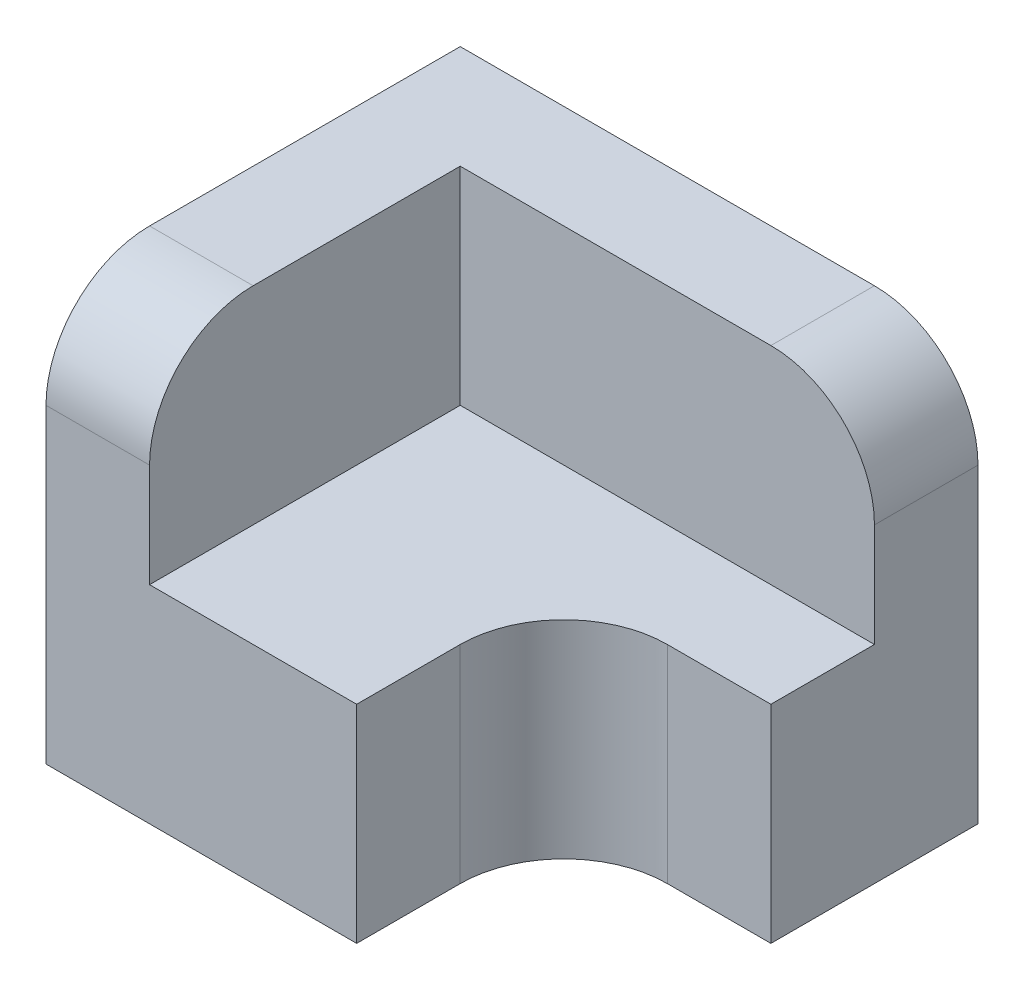
ISO-10303-21;
HEADER;
FILE_DESCRIPTION(('STEP AP214'),'2;1');
FILE_NAME('part.step','',(''),(''),'','','');
FILE_SCHEMA(('AUTOMOTIVE_DESIGN { 1 0 10303 214 1 1 1 1 }'));
ENDSEC;
DATA;
#1=APPLICATION_CONTEXT('core data for automotive mechanical design processes');
#2=APPLICATION_PROTOCOL_DEFINITION('international standard','automotive_design',2000,#1);
#3=PRODUCT_CONTEXT('',#1,'mechanical');
#4=PRODUCT('Part','Part','',(#3));
#5=PRODUCT_RELATED_PRODUCT_CATEGORY('part','',(#4));
#6=PRODUCT_DEFINITION_FORMATION('','',#4);
#7=PRODUCT_DEFINITION_CONTEXT('part definition',#1,'design');
#8=PRODUCT_DEFINITION('design','',#6,#7);
#9=PRODUCT_DEFINITION_SHAPE('','',#8);
#10=(LENGTH_UNIT() NAMED_UNIT(*) SI_UNIT(.MILLI.,.METRE.));
#11=(NAMED_UNIT(*) PLANE_ANGLE_UNIT() SI_UNIT($,.RADIAN.));
#12=(NAMED_UNIT(*) SI_UNIT($,.STERADIAN.) SOLID_ANGLE_UNIT());
#13=UNCERTAINTY_MEASURE_WITH_UNIT(LENGTH_MEASURE(1.E-05),#10,'distance_accuracy_value','');
#14=(GEOMETRIC_REPRESENTATION_CONTEXT(3) GLOBAL_UNCERTAINTY_ASSIGNED_CONTEXT((#13)) GLOBAL_UNIT_ASSIGNED_CONTEXT((#10,
#11,#12)) REPRESENTATION_CONTEXT('',''));
#15=CARTESIAN_POINT('',(0.,0.,0.));
#16=DIRECTION('',(0.,0.,1.));
#17=DIRECTION('',(1.,0.,0.));
#18=AXIS2_PLACEMENT_3D('',#15,#16,#17);
#19=CARTESIAN_POINT('',(-1.97907446432426,8.56735494335471,-1.66362461737447));
#20=DIRECTION('',(0.,1.,0.));
#21=DIRECTION('',(0.,0.,1.));
#22=AXIS2_PLACEMENT_3D('',#19,#20,#21);
#23=PLANE('',#22);
#24=DIRECTION('',(-1.,0.,0.));
#25=VECTOR('',#24,1.);
#26=CARTESIAN_POINT('',(-1.97907446432426,8.56735494335471,-2.66362461737447));
#27=LINE('',#26,#25);
#28=CARTESIAN_POINT('',(0.520925535675743,8.56735494335471,-2.66362461737447));
#29=VERTEX_POINT('',#28);
#30=CARTESIAN_POINT('',(-3.47907446432426,8.56735494335471,-2.66362461737447));
#31=VERTEX_POINT('',#30);
#32=EDGE_CURVE('E150',#29,#31,#27,.T.);
#33=ORIENTED_EDGE('',*,*,#32,.T.);
#34=DIRECTION('',(0.,0.,1.));
#35=VECTOR('',#34,1.);
#36=CARTESIAN_POINT('',(-3.47907446432426,8.56735494335471,-1.66362461737447));
#37=LINE('',#36,#35);
#38=CARTESIAN_POINT('',(-3.47907446432426,8.56735494335471,0.336375382625533));
#39=VERTEX_POINT('',#38);
#40=EDGE_CURVE('E149',#31,#39,#37,.T.);
#41=ORIENTED_EDGE('',*,*,#40,.T.);
#42=DIRECTION('',(1.,0.,0.));
#43=VECTOR('',#42,1.);
#44=CARTESIAN_POINT('',(-1.97907446432426,8.56735494335471,0.336375382625533));
#45=LINE('',#44,#43);
#46=CARTESIAN_POINT('',(-1.47907446432426,8.56735494335471,0.336375382625533));
#47=VERTEX_POINT('',#46);
#48=EDGE_CURVE('E163',#39,#47,#45,.T.);
#49=ORIENTED_EDGE('',*,*,#48,.T.);
#50=DIRECTION('',(0.,0.,-1.));
#51=VECTOR('',#50,1.);
#52=CARTESIAN_POINT('',(-1.47907446432426,8.56735494335471,-1.66362461737447));
#53=LINE('',#52,#51);
#54=CARTESIAN_POINT('',(-1.47907446432426,8.56735494335471,-0.66362461737446));
#55=VERTEX_POINT('',#54);
#56=EDGE_CURVE('E166',#47,#55,#53,.T.);
#57=ORIENTED_EDGE('',*,*,#56,.T.);
#58=CARTESIAN_POINT('',(-0.479074464324257,8.56735494335471,-0.663624617374467));
#59=DIRECTION('',(0.,1.,0.));
#60=DIRECTION('',(0.,0.,1.));
#61=AXIS2_PLACEMENT_3D('',#58,#59,#60);
#62=CIRCLE('',#61,1.);
#63=CARTESIAN_POINT('',(-0.47907446432425,8.56735494335471,-1.66362461737447));
#64=VERTEX_POINT('',#63);
#65=EDGE_CURVE('E168',#55,#64,#62,.F.);
#66=ORIENTED_EDGE('',*,*,#65,.T.);
#67=DIRECTION('',(-1.,0.,0.));
#68=VECTOR('',#67,1.);
#69=CARTESIAN_POINT('',(-1.97907446432426,8.56735494335471,-1.66362461737447));
#70=LINE('',#69,#68);
#71=CARTESIAN_POINT('',(0.520925535675743,8.56735494335471,-1.66362461737447));
#72=VERTEX_POINT('',#71);
#73=EDGE_CURVE('E170',#72,#64,#70,.T.);
#74=ORIENTED_EDGE('',*,*,#73,.F.);
#75=DIRECTION('',(0.,0.,-1.));
#76=VECTOR('',#75,1.);
#77=CARTESIAN_POINT('',(0.520925535675743,8.56735494335471,-1.66362461737447));
#78=LINE('',#77,#76);
#79=EDGE_CURVE('E160',#72,#29,#78,.T.);
#80=ORIENTED_EDGE('',*,*,#79,.T.);
#81=EDGE_LOOP('',(#33,#41,#49,#57,#66,#74,#80));
#82=FACE_BOUND('',#81,.T.);
#83=ADVANCED_FACE('F38',(#82),#23,.T.);
#84=CARTESIAN_POINT('',(0.520925535675743,8.56735494335471,-1.66362461737447));
#85=DIRECTION('',(-1.,0.,0.));
#86=DIRECTION('',(0.,0.,1.));
#87=AXIS2_PLACEMENT_3D('',#84,#85,#86);
#88=PLANE('',#87);
#89=DIRECTION('',(0.,-1.,0.));
#90=VECTOR('',#89,1.);
#91=CARTESIAN_POINT('',(0.520925535675743,8.56735494335471,-3.66362461737447));
#92=LINE('',#91,#90);
#93=CARTESIAN_POINT('',(0.520925535675743,9.56735494335471,-3.66362461737447));
#94=VERTEX_POINT('',#93);
#95=CARTESIAN_POINT('',(0.520925535675743,6.56735494335471,-3.66362461737447));
#96=VERTEX_POINT('',#95);
#97=EDGE_CURVE('E204',#94,#96,#92,.T.);
#98=ORIENTED_EDGE('',*,*,#97,.F.);
#99=DIRECTION('',(0.,0.,-1.));
#100=VECTOR('',#99,1.);
#101=CARTESIAN_POINT('',(0.520925535675743,9.56735494335471,-2.66362461737447));
#102=LINE('',#101,#100);
#103=CARTESIAN_POINT('',(0.520925535675743,9.56735494335471,-2.66362461737447));
#104=VERTEX_POINT('',#103);
#105=EDGE_CURVE('E46',#94,#104,#102,.F.);
#106=ORIENTED_EDGE('',*,*,#105,.T.);
#107=DIRECTION('',(0.,-1.,0.));
#108=VECTOR('',#107,1.);
#109=CARTESIAN_POINT('',(0.520925535675743,10.5673549433547,-2.66362461737447));
#110=LINE('',#109,#108);
#111=EDGE_CURVE('E151',#104,#29,#110,.T.);
#112=ORIENTED_EDGE('',*,*,#111,.T.);
#113=ORIENTED_EDGE('',*,*,#79,.F.);
#114=DIRECTION('',(0.,-1.,0.));
#115=VECTOR('',#114,1.);
#116=CARTESIAN_POINT('',(0.520925535675743,8.56735494335471,-1.66362461737447));
#117=LINE('',#116,#115);
#118=CARTESIAN_POINT('',(0.520925535675743,6.56735494335471,-1.66362461737447));
#119=VERTEX_POINT('',#118);
#120=EDGE_CURVE('E173',#72,#119,#117,.T.);
#121=ORIENTED_EDGE('',*,*,#120,.T.);
#122=DIRECTION('',(0.,0.,-1.));
#123=VECTOR('',#122,1.);
#124=CARTESIAN_POINT('',(0.520925535675743,6.56735494335471,-1.66362461737447));
#125=LINE('',#124,#123);
#126=EDGE_CURVE('E159',#119,#96,#125,.T.);
#127=ORIENTED_EDGE('',*,*,#126,.T.);
#128=EDGE_LOOP('',(#98,#106,#112,#113,#121,#127));
#129=FACE_BOUND('',#128,.T.);
#130=ADVANCED_FACE('F256',(#129),#88,.F.);
#131=CARTESIAN_POINT('',(-1.97907446432426,8.56735494335471,-3.66362461737447));
#132=DIRECTION('',(0.,0.,-1.));
#133=DIRECTION('',(-1.,0.,0.));
#134=AXIS2_PLACEMENT_3D('',#131,#132,#133);
#135=PLANE('',#134);
#136=DIRECTION('',(1.,0.,0.));
#137=VECTOR('',#136,1.);
#138=CARTESIAN_POINT('',(-1.97907446432426,10.5673549433547,-3.66362461737447));
#139=LINE('',#138,#137);
#140=CARTESIAN_POINT('',(-4.47907446432426,10.5673549433547,-3.66362461737447));
#141=VERTEX_POINT('',#140);
#142=CARTESIAN_POINT('',(-0.479074464324257,10.5673549433547,-3.66362461737447));
#143=VERTEX_POINT('',#142);
#144=EDGE_CURVE('E144',#141,#143,#139,.T.);
#145=ORIENTED_EDGE('',*,*,#144,.T.);
#146=CARTESIAN_POINT('',(-0.479074464324257,9.56735494335471,-3.66362461737447));
#147=DIRECTION('',(0.,0.,-1.));
#148=DIRECTION('',(-1.,0.,0.));
#149=AXIS2_PLACEMENT_3D('',#146,#147,#148);
#150=CIRCLE('',#149,1.);
#151=EDGE_CURVE('E60',#143,#94,#150,.T.);
#152=ORIENTED_EDGE('',*,*,#151,.T.);
#153=ORIENTED_EDGE('',*,*,#97,.T.);
#154=DIRECTION('',(1.,0.,0.));
#155=VECTOR('',#154,1.);
#156=CARTESIAN_POINT('',(-1.97907446432426,6.56735494335471,-3.66362461737447));
#157=LINE('',#156,#155);
#158=CARTESIAN_POINT('',(-4.47907446432426,6.56735494335471,-3.66362461737447));
#159=VERTEX_POINT('',#158);
#160=EDGE_CURVE('E176',#159,#96,#157,.T.);
#161=ORIENTED_EDGE('',*,*,#160,.F.);
#162=DIRECTION('',(0.,-1.,0.));
#163=VECTOR('',#162,1.);
#164=CARTESIAN_POINT('',(-4.47907446432426,8.56735494335471,-3.66362461737447));
#165=LINE('',#164,#163);
#166=EDGE_CURVE('E202',#141,#159,#165,.T.);
#167=ORIENTED_EDGE('',*,*,#166,.F.);
#168=EDGE_LOOP('',(#145,#152,#153,#161,#167));
#169=FACE_BOUND('',#168,.T.);
#170=ADVANCED_FACE('F233',(#169),#135,.T.);
#171=CARTESIAN_POINT('',(-4.47907446432426,8.56735494335471,-1.66362461737447));
#172=DIRECTION('',(-1.,0.,0.));
#173=DIRECTION('',(0.,0.,1.));
#174=AXIS2_PLACEMENT_3D('',#171,#172,#173);
#175=PLANE('',#174);
#176=DIRECTION('',(0.,-1.,0.));
#177=VECTOR('',#176,1.);
#178=CARTESIAN_POINT('',(-4.47907446432426,8.56735494335471,0.336375382625533));
#179=LINE('',#178,#177);
#180=CARTESIAN_POINT('',(-4.47907446432426,9.56735494335471,0.336375382625533));
#181=VERTEX_POINT('',#180);
#182=CARTESIAN_POINT('',(-4.47907446432426,6.56735494335471,0.336375382625533));
#183=VERTEX_POINT('',#182);
#184=EDGE_CURVE('E200',#181,#183,#179,.T.);
#185=ORIENTED_EDGE('',*,*,#184,.F.);
#186=CARTESIAN_POINT('',(-4.47907446432426,9.56735494335471,-0.663624617374467));
#187=DIRECTION('',(-1.,0.,0.));
#188=DIRECTION('',(0.,0.,1.));
#189=AXIS2_PLACEMENT_3D('',#186,#187,#188);
#190=CIRCLE('',#189,1.);
#191=CARTESIAN_POINT('',(-4.47907446432426,10.5673549433547,-0.663624617374467));
#192=VERTEX_POINT('',#191);
#193=EDGE_CURVE('E213',#181,#192,#190,.T.);
#194=ORIENTED_EDGE('',*,*,#193,.T.);
#195=DIRECTION('',(0.,0.,-1.));
#196=VECTOR('',#195,1.);
#197=CARTESIAN_POINT('',(-4.47907446432426,10.5673549433547,-1.66362461737447));
#198=LINE('',#197,#196);
#199=EDGE_CURVE('E219',#192,#141,#198,.T.);
#200=ORIENTED_EDGE('',*,*,#199,.T.);
#201=ORIENTED_EDGE('',*,*,#166,.T.);
#202=DIRECTION('',(0.,0.,-1.));
#203=VECTOR('',#202,1.);
#204=CARTESIAN_POINT('',(-4.47907446432426,6.56735494335471,-1.66362461737447));
#205=LINE('',#204,#203);
#206=EDGE_CURVE('E179',#183,#159,#205,.T.);
#207=ORIENTED_EDGE('',*,*,#206,.F.);
#208=EDGE_LOOP('',(#185,#194,#200,#201,#207));
#209=FACE_BOUND('',#208,.T.);
#210=ADVANCED_FACE('F218',(#209),#175,.T.);
#211=CARTESIAN_POINT('',(-1.97907446432426,8.56735494335471,0.336375382625533));
#212=DIRECTION('',(0.,0.,-1.));
#213=DIRECTION('',(-1.,0.,0.));
#214=AXIS2_PLACEMENT_3D('',#211,#212,#213);
#215=PLANE('',#214);
#216=DIRECTION('',(0.,-1.,0.));
#217=VECTOR('',#216,1.);
#218=CARTESIAN_POINT('',(-3.47907446432426,10.5673549433547,0.336375382625533));
#219=LINE('',#218,#217);
#220=CARTESIAN_POINT('',(-3.47907446432426,9.56735494335471,0.336375382625533));
#221=VERTEX_POINT('',#220);
#222=EDGE_CURVE('E154',#221,#39,#219,.T.);
#223=ORIENTED_EDGE('',*,*,#222,.F.);
#224=DIRECTION('',(1.,0.,0.));
#225=VECTOR('',#224,1.);
#226=CARTESIAN_POINT('',(-4.47907446432426,9.56735494335471,0.336375382625533));
#227=LINE('',#226,#225);
#228=EDGE_CURVE('E211',#221,#181,#227,.F.);
#229=ORIENTED_EDGE('',*,*,#228,.T.);
#230=ORIENTED_EDGE('',*,*,#184,.T.);
#231=DIRECTION('',(1.,0.,0.));
#232=VECTOR('',#231,1.);
#233=CARTESIAN_POINT('',(-1.97907446432426,6.56735494335471,0.336375382625533));
#234=LINE('',#233,#232);
#235=CARTESIAN_POINT('',(-1.47907446432426,6.56735494335471,0.336375382625533));
#236=VERTEX_POINT('',#235);
#237=EDGE_CURVE('E182',#183,#236,#234,.T.);
#238=ORIENTED_EDGE('',*,*,#237,.T.);
#239=DIRECTION('',(0.,-1.,0.));
#240=VECTOR('',#239,1.);
#241=CARTESIAN_POINT('',(-1.47907446432426,8.56735494335471,0.336375382625533));
#242=LINE('',#241,#240);
#243=EDGE_CURVE('E197',#47,#236,#242,.T.);
#244=ORIENTED_EDGE('',*,*,#243,.F.);
#245=ORIENTED_EDGE('',*,*,#48,.F.);
#246=EDGE_LOOP('',(#223,#229,#230,#238,#244,#245));
#247=FACE_BOUND('',#246,.T.);
#248=ADVANCED_FACE('F230',(#247),#215,.F.);
#249=CARTESIAN_POINT('',(-1.47907446432426,8.56735494335471,-1.66362461737447));
#250=DIRECTION('',(-1.,0.,0.));
#251=DIRECTION('',(0.,0.,1.));
#252=AXIS2_PLACEMENT_3D('',#249,#250,#251);
#253=PLANE('',#252);
#254=DIRECTION('',(0.,0.,-1.));
#255=VECTOR('',#254,1.);
#256=CARTESIAN_POINT('',(-1.47907446432426,6.56735494335471,-1.66362461737447));
#257=LINE('',#256,#255);
#258=CARTESIAN_POINT('',(-1.47907446432426,6.56735494335471,-0.66362461737446));
#259=VERTEX_POINT('',#258);
#260=EDGE_CURVE('E184',#236,#259,#257,.T.);
#261=ORIENTED_EDGE('',*,*,#260,.T.);
#262=DIRECTION('',(0.,-1.,0.));
#263=VECTOR('',#262,1.);
#264=CARTESIAN_POINT('',(-1.47907446432426,8.56735494335471,-0.66362461737446));
#265=LINE('',#264,#263);
#266=EDGE_CURVE('E194',#55,#259,#265,.T.);
#267=ORIENTED_EDGE('',*,*,#266,.F.);
#268=ORIENTED_EDGE('',*,*,#56,.F.);
#269=ORIENTED_EDGE('',*,*,#243,.T.);
#270=EDGE_LOOP('',(#261,#267,#268,#269));
#271=FACE_BOUND('',#270,.T.);
#272=ADVANCED_FACE('F243',(#271),#253,.F.);
#273=CARTESIAN_POINT('',(-0.479074464324257,8.56735494335471,-0.663624617374467));
#274=DIRECTION('',(0.,-1.,0.));
#275=DIRECTION('',(0.,0.,-1.));
#276=AXIS2_PLACEMENT_3D('',#273,#274,#275);
#277=CYLINDRICAL_SURFACE('',#276,1.);
#278=CARTESIAN_POINT('',(-0.479074464324257,6.56735494335471,-0.663624617374467));
#279=DIRECTION('',(0.,1.,0.));
#280=DIRECTION('',(0.,0.,1.));
#281=AXIS2_PLACEMENT_3D('',#278,#279,#280);
#282=CIRCLE('',#281,1.);
#283=CARTESIAN_POINT('',(-0.47907446432425,6.56735494335471,-1.66362461737447));
#284=VERTEX_POINT('',#283);
#285=EDGE_CURVE('E186',#259,#284,#282,.F.);
#286=ORIENTED_EDGE('',*,*,#285,.T.);
#287=DIRECTION('',(0.,-1.,0.));
#288=VECTOR('',#287,1.);
#289=CARTESIAN_POINT('',(-0.47907446432425,8.56735494335471,-1.66362461737447));
#290=LINE('',#289,#288);
#291=EDGE_CURVE('E192',#64,#284,#290,.T.);
#292=ORIENTED_EDGE('',*,*,#291,.F.);
#293=ORIENTED_EDGE('',*,*,#65,.F.);
#294=ORIENTED_EDGE('',*,*,#266,.T.);
#295=EDGE_LOOP('',(#286,#292,#293,#294));
#296=FACE_BOUND('',#295,.T.);
#297=ADVANCED_FACE('F270',(#296),#277,.F.);
#298=CARTESIAN_POINT('',(-1.97907446432426,8.56735494335471,-1.66362461737447));
#299=DIRECTION('',(0.,0.,1.));
#300=DIRECTION('',(1.,0.,0.));
#301=AXIS2_PLACEMENT_3D('',#298,#299,#300);
#302=PLANE('',#301);
#303=DIRECTION('',(-1.,0.,0.));
#304=VECTOR('',#303,1.);
#305=CARTESIAN_POINT('',(-1.97907446432426,6.56735494335471,-1.66362461737447));
#306=LINE('',#305,#304);
#307=EDGE_CURVE('E164',#119,#284,#306,.T.);
#308=ORIENTED_EDGE('',*,*,#307,.F.);
#309=ORIENTED_EDGE('',*,*,#120,.F.);
#310=ORIENTED_EDGE('',*,*,#73,.T.);
#311=ORIENTED_EDGE('',*,*,#291,.T.);
#312=EDGE_LOOP('',(#308,#309,#310,#311));
#313=FACE_BOUND('',#312,.T.);
#314=ADVANCED_FACE('F267',(#313),#302,.T.);
#315=CARTESIAN_POINT('',(-1.97907446432426,6.56735494335471,-1.66362461737447));
#316=DIRECTION('',(0.,1.,0.));
#317=DIRECTION('',(0.,0.,1.));
#318=AXIS2_PLACEMENT_3D('',#315,#316,#317);
#319=PLANE('',#318);
#320=ORIENTED_EDGE('',*,*,#260,.F.);
#321=ORIENTED_EDGE('',*,*,#237,.F.);
#322=ORIENTED_EDGE('',*,*,#206,.T.);
#323=ORIENTED_EDGE('',*,*,#160,.T.);
#324=ORIENTED_EDGE('',*,*,#126,.F.);
#325=ORIENTED_EDGE('',*,*,#307,.T.);
#326=ORIENTED_EDGE('',*,*,#285,.F.);
#327=EDGE_LOOP('',(#320,#321,#322,#323,#324,#325,#326));
#328=FACE_BOUND('',#327,.T.);
#329=ADVANCED_FACE('F238',(#328),#319,.F.);
#330=CARTESIAN_POINT('',(-3.47907446432426,10.5673549433547,-1.66362461737447));
#331=DIRECTION('',(-1.,0.,0.));
#332=DIRECTION('',(0.,0.,1.));
#333=AXIS2_PLACEMENT_3D('',#330,#331,#332);
#334=PLANE('',#333);
#335=DIRECTION('',(0.,0.,-1.));
#336=VECTOR('',#335,1.);
#337=CARTESIAN_POINT('',(-3.47907446432426,10.5673549433547,-1.66362461737447));
#338=LINE('',#337,#336);
#339=CARTESIAN_POINT('',(-3.47907446432426,10.5673549433547,-0.663624617374467));
#340=VERTEX_POINT('',#339);
#341=CARTESIAN_POINT('',(-3.47907446432426,10.5673549433547,-2.66362461737447));
#342=VERTEX_POINT('',#341);
#343=EDGE_CURVE('E126',#340,#342,#338,.T.);
#344=ORIENTED_EDGE('',*,*,#343,.F.);
#345=CARTESIAN_POINT('',(-3.47907446432426,9.56735494335471,-0.663624617374467));
#346=DIRECTION('',(-1.,0.,0.));
#347=DIRECTION('',(0.,0.,1.));
#348=AXIS2_PLACEMENT_3D('',#345,#346,#347);
#349=CIRCLE('',#348,1.);
#350=EDGE_CURVE('E209',#340,#221,#349,.F.);
#351=ORIENTED_EDGE('',*,*,#350,.T.);
#352=ORIENTED_EDGE('',*,*,#222,.T.);
#353=ORIENTED_EDGE('',*,*,#40,.F.);
#354=DIRECTION('',(0.,-1.,0.));
#355=VECTOR('',#354,1.);
#356=CARTESIAN_POINT('',(-3.47907446432426,10.5673549433547,-2.66362461737447));
#357=LINE('',#356,#355);
#358=EDGE_CURVE('E142',#342,#31,#357,.T.);
#359=ORIENTED_EDGE('',*,*,#358,.F.);
#360=EDGE_LOOP('',(#344,#351,#352,#353,#359));
#361=FACE_BOUND('',#360,.T.);
#362=ADVANCED_FACE('F147',(#361),#334,.F.);
#363=CARTESIAN_POINT('',(-1.97907446432426,10.5673549433547,-2.66362461737447));
#364=DIRECTION('',(0.,0.,-1.));
#365=DIRECTION('',(-1.,0.,0.));
#366=AXIS2_PLACEMENT_3D('',#363,#364,#365);
#367=PLANE('',#366);
#368=ORIENTED_EDGE('',*,*,#111,.F.);
#369=CARTESIAN_POINT('',(-0.479074464324257,9.56735494335471,-2.66362461737447));
#370=DIRECTION('',(0.,0.,-1.));
#371=DIRECTION('',(-1.,0.,0.));
#372=AXIS2_PLACEMENT_3D('',#369,#370,#371);
#373=CIRCLE('',#372,1.);
#374=CARTESIAN_POINT('',(-0.479074464324257,10.5673549433547,-2.66362461737447));
#375=VERTEX_POINT('',#374);
#376=EDGE_CURVE('E11',#104,#375,#373,.F.);
#377=ORIENTED_EDGE('',*,*,#376,.T.);
#378=DIRECTION('',(1.,0.,0.));
#379=VECTOR('',#378,1.);
#380=CARTESIAN_POINT('',(-1.97907446432426,10.5673549433547,-2.66362461737447));
#381=LINE('',#380,#379);
#382=EDGE_CURVE('E131',#342,#375,#381,.T.);
#383=ORIENTED_EDGE('',*,*,#382,.F.);
#384=ORIENTED_EDGE('',*,*,#358,.T.);
#385=ORIENTED_EDGE('',*,*,#32,.F.);
#386=EDGE_LOOP('',(#368,#377,#383,#384,#385));
#387=FACE_BOUND('',#386,.T.);
#388=ADVANCED_FACE('F140',(#387),#367,.F.);
#389=CARTESIAN_POINT('',(-1.97907446432426,10.5673549433547,-1.66362461737447));
#390=DIRECTION('',(0.,1.,0.));
#391=DIRECTION('',(0.,0.,1.));
#392=AXIS2_PLACEMENT_3D('',#389,#390,#391);
#393=PLANE('',#392);
#394=ORIENTED_EDGE('',*,*,#199,.F.);
#395=DIRECTION('',(1.,0.,0.));
#396=VECTOR('',#395,1.);
#397=CARTESIAN_POINT('',(-3.47907446432426,10.5673549433547,-0.663624617374467));
#398=LINE('',#397,#396);
#399=EDGE_CURVE('E134',#192,#340,#398,.T.);
#400=ORIENTED_EDGE('',*,*,#399,.T.);
#401=ORIENTED_EDGE('',*,*,#343,.T.);
#402=ORIENTED_EDGE('',*,*,#382,.T.);
#403=DIRECTION('',(0.,0.,-1.));
#404=VECTOR('',#403,1.);
#405=CARTESIAN_POINT('',(-0.479074464324257,10.5673549433547,-3.66362461737447));
#406=LINE('',#405,#404);
#407=EDGE_CURVE('E206',#375,#143,#406,.T.);
#408=ORIENTED_EDGE('',*,*,#407,.T.);
#409=ORIENTED_EDGE('',*,*,#144,.F.);
#410=EDGE_LOOP('',(#394,#400,#401,#402,#408,#409));
#411=FACE_BOUND('',#410,.T.);
#412=ADVANCED_FACE('F129',(#411),#393,.T.);
#413=CARTESIAN_POINT('',(-1.97907446432426,9.56735494335471,-0.663624617374467));
#414=DIRECTION('',(-1.,0.,0.));
#415=DIRECTION('',(0.,0.,1.));
#416=AXIS2_PLACEMENT_3D('',#413,#414,#415);
#417=CYLINDRICAL_SURFACE('',#416,1.);
#418=ORIENTED_EDGE('',*,*,#193,.F.);
#419=ORIENTED_EDGE('',*,*,#228,.F.);
#420=ORIENTED_EDGE('',*,*,#350,.F.);
#421=ORIENTED_EDGE('',*,*,#399,.F.);
#422=EDGE_LOOP('',(#418,#419,#420,#421));
#423=FACE_BOUND('',#422,.T.);
#424=ADVANCED_FACE('F226',(#423),#417,.T.);
#425=CARTESIAN_POINT('',(-0.479074464324257,9.56735494335471,-1.66362461737447));
#426=DIRECTION('',(0.,0.,1.));
#427=DIRECTION('',(1.,0.,0.));
#428=AXIS2_PLACEMENT_3D('',#425,#426,#427);
#429=CYLINDRICAL_SURFACE('',#428,1.);
#430=ORIENTED_EDGE('',*,*,#376,.F.);
#431=ORIENTED_EDGE('',*,*,#105,.F.);
#432=ORIENTED_EDGE('',*,*,#151,.F.);
#433=ORIENTED_EDGE('',*,*,#407,.F.);
#434=EDGE_LOOP('',(#430,#431,#432,#433));
#435=FACE_BOUND('',#434,.T.);
#436=ADVANCED_FACE('F40',(#435),#429,.T.);
#437=CLOSED_SHELL('',(#83,#130,#170,#210,#248,#272,#297,#314,#329,#362,#388,#412,#424,#436));
#438=MANIFOLD_SOLID_BREP('B2',#437);
#439=ADVANCED_BREP_SHAPE_REPRESENTATION('',(#18,#438),#14);
#440=SHAPE_DEFINITION_REPRESENTATION(#9,#439);
ENDSEC;
END-ISO-10303-21;
